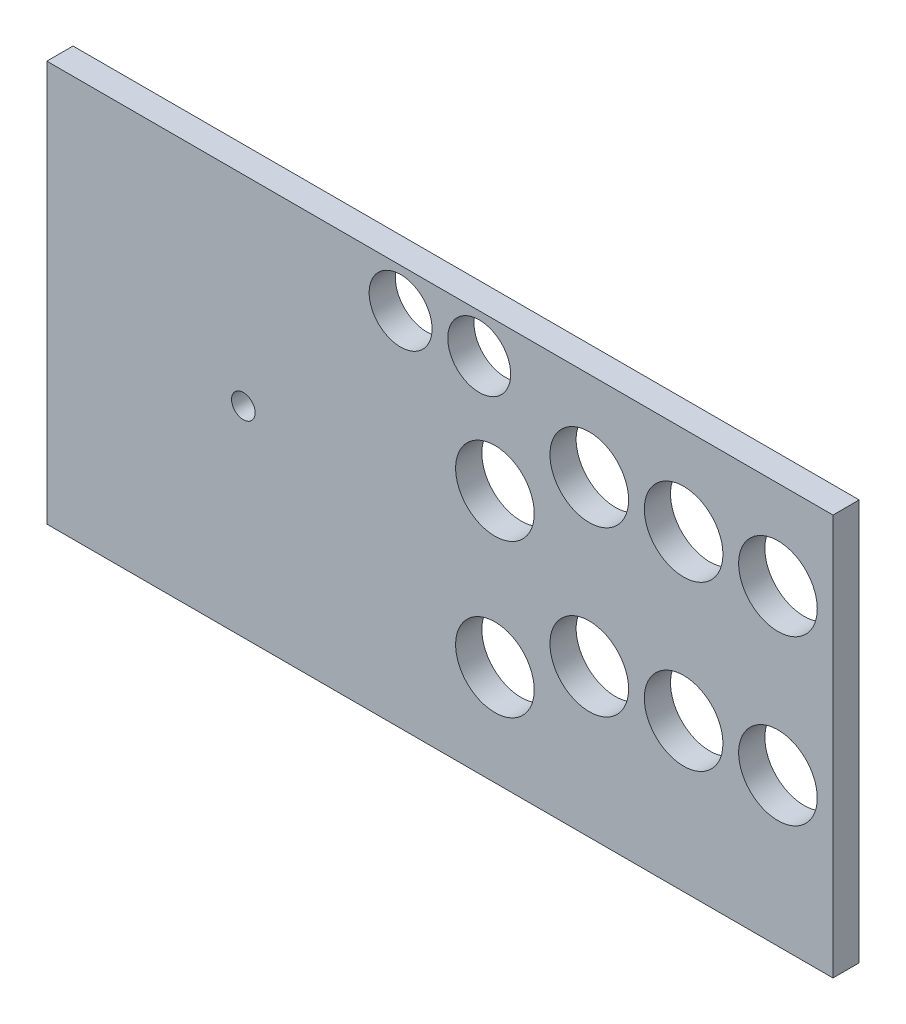
ISO-10303-21;
HEADER;
FILE_DESCRIPTION(('STEP AP214'),'2;1');
FILE_NAME('part.step','',(''),(''),'','','');
FILE_SCHEMA(('AUTOMOTIVE_DESIGN { 1 0 10303 214 1 1 1 1 }'));
ENDSEC;
DATA;
#1=APPLICATION_CONTEXT('core data for automotive mechanical design processes');
#2=APPLICATION_PROTOCOL_DEFINITION('international standard','automotive_design',2000,#1);
#3=PRODUCT_CONTEXT('',#1,'mechanical');
#4=PRODUCT('Part','Part','',(#3));
#5=PRODUCT_RELATED_PRODUCT_CATEGORY('part','',(#4));
#6=PRODUCT_DEFINITION_FORMATION('','',#4);
#7=PRODUCT_DEFINITION_CONTEXT('part definition',#1,'design');
#8=PRODUCT_DEFINITION('design','',#6,#7);
#9=PRODUCT_DEFINITION_SHAPE('','',#8);
#10=(LENGTH_UNIT() NAMED_UNIT(*) SI_UNIT(.MILLI.,.METRE.));
#11=(NAMED_UNIT(*) PLANE_ANGLE_UNIT() SI_UNIT($,.RADIAN.));
#12=(NAMED_UNIT(*) SI_UNIT($,.STERADIAN.) SOLID_ANGLE_UNIT());
#13=UNCERTAINTY_MEASURE_WITH_UNIT(LENGTH_MEASURE(1.E-05),#10,'distance_accuracy_value','');
#14=(GEOMETRIC_REPRESENTATION_CONTEXT(3) GLOBAL_UNCERTAINTY_ASSIGNED_CONTEXT((#13)) GLOBAL_UNIT_ASSIGNED_CONTEXT((#10,
#11,#12)) REPRESENTATION_CONTEXT('',''));
#15=CARTESIAN_POINT('',(0.,0.,0.));
#16=DIRECTION('',(0.,0.,1.));
#17=DIRECTION('',(1.,0.,0.));
#18=AXIS2_PLACEMENT_3D('',#15,#16,#17);
#19=CARTESIAN_POINT('',(0.,0.,10.));
#20=DIRECTION('',(1.,0.,0.));
#21=DIRECTION('',(0.,0.,-1.));
#22=AXIS2_PLACEMENT_3D('',#19,#20,#21);
#23=PLANE('',#22);
#24=DIRECTION('',(0.,-1.,0.));
#25=VECTOR('',#24,1.);
#26=CARTESIAN_POINT('',(0.,0.,0.));
#27=LINE('',#26,#25);
#28=CARTESIAN_POINT('',(0.,153.,0.));
#29=VERTEX_POINT('',#28);
#30=CARTESIAN_POINT('',(0.,0.,0.));
#31=VERTEX_POINT('',#30);
#32=EDGE_CURVE('E99',#29,#31,#27,.T.);
#33=ORIENTED_EDGE('',*,*,#32,.T.);
#34=DIRECTION('',(0.,0.,-1.));
#35=VECTOR('',#34,1.);
#36=CARTESIAN_POINT('',(0.,0.,10.));
#37=LINE('',#36,#35);
#38=CARTESIAN_POINT('',(0.,0.,10.));
#39=VERTEX_POINT('',#38);
#40=EDGE_CURVE('E11',#39,#31,#37,.T.);
#41=ORIENTED_EDGE('',*,*,#40,.F.);
#42=DIRECTION('',(0.,-1.,0.));
#43=VECTOR('',#42,1.);
#44=CARTESIAN_POINT('',(0.,0.,10.));
#45=LINE('',#44,#43);
#46=CARTESIAN_POINT('',(0.,153.,10.));
#47=VERTEX_POINT('',#46);
#48=EDGE_CURVE('E87',#47,#39,#45,.T.);
#49=ORIENTED_EDGE('',*,*,#48,.F.);
#50=DIRECTION('',(0.,0.,-1.));
#51=VECTOR('',#50,1.);
#52=CARTESIAN_POINT('',(0.,153.,10.));
#53=LINE('',#52,#51);
#54=EDGE_CURVE('E95',#47,#29,#53,.T.);
#55=ORIENTED_EDGE('',*,*,#54,.T.);
#56=EDGE_LOOP('',(#33,#41,#49,#55));
#57=FACE_BOUND('',#56,.T.);
#58=ADVANCED_FACE('F36',(#57),#23,.F.);
#59=CARTESIAN_POINT('',(0.,0.,10.));
#60=DIRECTION('',(0.,1.,0.));
#61=DIRECTION('',(0.,0.,1.));
#62=AXIS2_PLACEMENT_3D('',#59,#60,#61);
#63=PLANE('',#62);
#64=DIRECTION('',(1.,0.,0.));
#65=VECTOR('',#64,1.);
#66=CARTESIAN_POINT('',(0.,0.,0.));
#67=LINE('',#66,#65);
#68=CARTESIAN_POINT('',(300.,0.,0.));
#69=VERTEX_POINT('',#68);
#70=EDGE_CURVE('E91',#31,#69,#67,.T.);
#71=ORIENTED_EDGE('',*,*,#70,.T.);
#72=DIRECTION('',(0.,0.,-1.));
#73=VECTOR('',#72,1.);
#74=CARTESIAN_POINT('',(300.,0.,10.));
#75=LINE('',#74,#73);
#76=CARTESIAN_POINT('',(300.,0.,10.));
#77=VERTEX_POINT('',#76);
#78=EDGE_CURVE('E44',#77,#69,#75,.T.);
#79=ORIENTED_EDGE('',*,*,#78,.F.);
#80=DIRECTION('',(1.,0.,0.));
#81=VECTOR('',#80,1.);
#82=CARTESIAN_POINT('',(0.,0.,10.));
#83=LINE('',#82,#81);
#84=EDGE_CURVE('E82',#39,#77,#83,.T.);
#85=ORIENTED_EDGE('',*,*,#84,.F.);
#86=ORIENTED_EDGE('',*,*,#40,.T.);
#87=EDGE_LOOP('',(#71,#79,#85,#86));
#88=FACE_BOUND('',#87,.T.);
#89=ADVANCED_FACE('F90',(#88),#63,.F.);
#90=CARTESIAN_POINT('',(300.,0.,10.));
#91=DIRECTION('',(-1.,0.,0.));
#92=DIRECTION('',(0.,0.,1.));
#93=AXIS2_PLACEMENT_3D('',#90,#91,#92);
#94=PLANE('',#93);
#95=DIRECTION('',(0.,1.,0.));
#96=VECTOR('',#95,1.);
#97=CARTESIAN_POINT('',(300.,0.,0.));
#98=LINE('',#97,#96);
#99=CARTESIAN_POINT('',(300.,153.,0.));
#100=VERTEX_POINT('',#99);
#101=EDGE_CURVE('E69',#69,#100,#98,.T.);
#102=ORIENTED_EDGE('',*,*,#101,.T.);
#103=DIRECTION('',(0.,0.,-1.));
#104=VECTOR('',#103,1.);
#105=CARTESIAN_POINT('',(300.,153.,10.));
#106=LINE('',#105,#104);
#107=CARTESIAN_POINT('',(300.,153.,10.));
#108=VERTEX_POINT('',#107);
#109=EDGE_CURVE('E92',#108,#100,#106,.T.);
#110=ORIENTED_EDGE('',*,*,#109,.F.);
#111=DIRECTION('',(0.,1.,0.));
#112=VECTOR('',#111,1.);
#113=CARTESIAN_POINT('',(300.,0.,10.));
#114=LINE('',#113,#112);
#115=EDGE_CURVE('E85',#77,#108,#114,.T.);
#116=ORIENTED_EDGE('',*,*,#115,.F.);
#117=ORIENTED_EDGE('',*,*,#78,.T.);
#118=EDGE_LOOP('',(#102,#110,#116,#117));
#119=FACE_BOUND('',#118,.T.);
#120=ADVANCED_FACE('F93',(#119),#94,.F.);
#121=CARTESIAN_POINT('',(0.,153.,10.));
#122=DIRECTION('',(0.,-1.,0.));
#123=DIRECTION('',(0.,0.,-1.));
#124=AXIS2_PLACEMENT_3D('',#121,#122,#123);
#125=PLANE('',#124);
#126=DIRECTION('',(-1.,0.,0.));
#127=VECTOR('',#126,1.);
#128=CARTESIAN_POINT('',(0.,153.,0.));
#129=LINE('',#128,#127);
#130=EDGE_CURVE('E75',#100,#29,#129,.T.);
#131=ORIENTED_EDGE('',*,*,#130,.T.);
#132=ORIENTED_EDGE('',*,*,#54,.F.);
#133=DIRECTION('',(-1.,0.,0.));
#134=VECTOR('',#133,1.);
#135=CARTESIAN_POINT('',(0.,153.,10.));
#136=LINE('',#135,#134);
#137=EDGE_CURVE('E52',#108,#47,#136,.T.);
#138=ORIENTED_EDGE('',*,*,#137,.F.);
#139=ORIENTED_EDGE('',*,*,#109,.T.);
#140=EDGE_LOOP('',(#131,#132,#138,#139));
#141=FACE_BOUND('',#140,.T.);
#142=ADVANCED_FACE('F107',(#141),#125,.F.);
#143=CARTESIAN_POINT('',(0.,0.,10.));
#144=DIRECTION('',(0.,0.,-1.));
#145=DIRECTION('',(-1.,0.,0.));
#146=AXIS2_PLACEMENT_3D('',#143,#144,#145);
#147=PLANE('',#146);
#148=CARTESIAN_POINT('',(75.,76.5,10.));
#149=DIRECTION('',(0.,0.,1.));
#150=DIRECTION('',(1.,0.,0.));
#151=AXIS2_PLACEMENT_3D('',#148,#149,#150);
#152=CIRCLE('',#151,4.50000000000001);
#153=CARTESIAN_POINT('',(79.5,76.5,10.));
#154=VERTEX_POINT('',#153);
#155=EDGE_CURVE('E173',#154,#154,#152,.T.);
#156=ORIENTED_EDGE('',*,*,#155,.F.);
#157=EDGE_LOOP('',(#156));
#158=FACE_BOUND('',#157,.T.);
#159=CARTESIAN_POINT('',(135.,138.,10.));
#160=DIRECTION('',(0.,0.,1.));
#161=DIRECTION('',(1.,0.,0.));
#162=AXIS2_PLACEMENT_3D('',#159,#160,#161);
#163=CIRCLE('',#162,12.);
#164=CARTESIAN_POINT('',(147.,138.,10.));
#165=VERTEX_POINT('',#164);
#166=EDGE_CURVE('E167',#165,#165,#163,.T.);
#167=ORIENTED_EDGE('',*,*,#166,.F.);
#168=EDGE_LOOP('',(#167));
#169=FACE_BOUND('',#168,.T.);
#170=CARTESIAN_POINT('',(165.,138.,10.));
#171=DIRECTION('',(0.,0.,1.));
#172=DIRECTION('',(1.,0.,0.));
#173=AXIS2_PLACEMENT_3D('',#170,#171,#172);
#174=CIRCLE('',#173,12.);
#175=CARTESIAN_POINT('',(177.,138.,10.));
#176=VERTEX_POINT('',#175);
#177=EDGE_CURVE('E161',#176,#176,#174,.T.);
#178=ORIENTED_EDGE('',*,*,#177,.F.);
#179=EDGE_LOOP('',(#178));
#180=FACE_BOUND('',#179,.T.);
#181=CARTESIAN_POINT('',(279.,56.5,10.));
#182=DIRECTION('',(0.,0.,1.));
#183=DIRECTION('',(1.,0.,0.));
#184=AXIS2_PLACEMENT_3D('',#181,#182,#183);
#185=CIRCLE('',#184,15.);
#186=CARTESIAN_POINT('',(294.,56.5,10.));
#187=VERTEX_POINT('',#186);
#188=EDGE_CURVE('E155',#187,#187,#185,.T.);
#189=ORIENTED_EDGE('',*,*,#188,.F.);
#190=EDGE_LOOP('',(#189));
#191=FACE_BOUND('',#190,.T.);
#192=CARTESIAN_POINT('',(243.,56.5,10.));
#193=DIRECTION('',(0.,0.,1.));
#194=DIRECTION('',(1.,0.,0.));
#195=AXIS2_PLACEMENT_3D('',#192,#193,#194);
#196=CIRCLE('',#195,15.);
#197=CARTESIAN_POINT('',(258.,56.5,10.));
#198=VERTEX_POINT('',#197);
#199=EDGE_CURVE('E149',#198,#198,#196,.T.);
#200=ORIENTED_EDGE('',*,*,#199,.F.);
#201=EDGE_LOOP('',(#200));
#202=FACE_BOUND('',#201,.T.);
#203=CARTESIAN_POINT('',(207.,56.5,10.));
#204=DIRECTION('',(0.,0.,1.));
#205=DIRECTION('',(1.,0.,0.));
#206=AXIS2_PLACEMENT_3D('',#203,#204,#205);
#207=CIRCLE('',#206,15.);
#208=CARTESIAN_POINT('',(222.,56.5,10.));
#209=VERTEX_POINT('',#208);
#210=EDGE_CURVE('E143',#209,#209,#207,.T.);
#211=ORIENTED_EDGE('',*,*,#210,.F.);
#212=EDGE_LOOP('',(#211));
#213=FACE_BOUND('',#212,.T.);
#214=CARTESIAN_POINT('',(171.,38.2,10.));
#215=DIRECTION('',(0.,0.,1.));
#216=DIRECTION('',(1.,0.,0.));
#217=AXIS2_PLACEMENT_3D('',#214,#215,#216);
#218=CIRCLE('',#217,15.);
#219=CARTESIAN_POINT('',(186.,38.2,10.));
#220=VERTEX_POINT('',#219);
#221=EDGE_CURVE('E137',#220,#220,#218,.T.);
#222=ORIENTED_EDGE('',*,*,#221,.F.);
#223=EDGE_LOOP('',(#222));
#224=FACE_BOUND('',#223,.T.);
#225=CARTESIAN_POINT('',(279.,119.,10.));
#226=DIRECTION('',(0.,0.,1.));
#227=DIRECTION('',(1.,0.,0.));
#228=AXIS2_PLACEMENT_3D('',#225,#226,#227);
#229=CIRCLE('',#228,15.);
#230=CARTESIAN_POINT('',(294.,119.,10.));
#231=VERTEX_POINT('',#230);
#232=EDGE_CURVE('E131',#231,#231,#229,.T.);
#233=ORIENTED_EDGE('',*,*,#232,.F.);
#234=EDGE_LOOP('',(#233));
#235=FACE_BOUND('',#234,.T.);
#236=CARTESIAN_POINT('',(243.,119.,10.));
#237=DIRECTION('',(0.,0.,1.));
#238=DIRECTION('',(1.,0.,0.));
#239=AXIS2_PLACEMENT_3D('',#236,#237,#238);
#240=CIRCLE('',#239,15.);
#241=CARTESIAN_POINT('',(258.,119.,10.));
#242=VERTEX_POINT('',#241);
#243=EDGE_CURVE('E125',#242,#242,#240,.T.);
#244=ORIENTED_EDGE('',*,*,#243,.F.);
#245=EDGE_LOOP('',(#244));
#246=FACE_BOUND('',#245,.T.);
#247=CARTESIAN_POINT('',(207.,119.,10.));
#248=DIRECTION('',(0.,0.,1.));
#249=DIRECTION('',(1.,0.,0.));
#250=AXIS2_PLACEMENT_3D('',#247,#248,#249);
#251=CIRCLE('',#250,15.);
#252=CARTESIAN_POINT('',(222.,119.,10.));
#253=VERTEX_POINT('',#252);
#254=EDGE_CURVE('E119',#253,#253,#251,.T.);
#255=ORIENTED_EDGE('',*,*,#254,.F.);
#256=EDGE_LOOP('',(#255));
#257=FACE_BOUND('',#256,.T.);
#258=CARTESIAN_POINT('',(171.,96.5,10.));
#259=DIRECTION('',(0.,0.,1.));
#260=DIRECTION('',(1.,0.,0.));
#261=AXIS2_PLACEMENT_3D('',#258,#259,#260);
#262=CIRCLE('',#261,15.);
#263=CARTESIAN_POINT('',(186.,96.5,10.));
#264=VERTEX_POINT('',#263);
#265=EDGE_CURVE('E113',#264,#264,#262,.T.);
#266=ORIENTED_EDGE('',*,*,#265,.F.);
#267=EDGE_LOOP('',(#266));
#268=FACE_BOUND('',#267,.T.);
#269=ORIENTED_EDGE('',*,*,#48,.T.);
#270=ORIENTED_EDGE('',*,*,#84,.T.);
#271=ORIENTED_EDGE('',*,*,#115,.T.);
#272=ORIENTED_EDGE('',*,*,#137,.T.);
#273=EDGE_LOOP('',(#269,#270,#271,#272));
#274=FACE_BOUND('',#273,.T.);
#275=ADVANCED_FACE('F83',(#158,#169,#180,#191,#202,#213,#224,#235,#246,#257,#268,#274),#147,.F.);
#276=CARTESIAN_POINT('',(0.,0.,0.));
#277=DIRECTION('',(0.,0.,-1.));
#278=DIRECTION('',(-1.,0.,0.));
#279=AXIS2_PLACEMENT_3D('',#276,#277,#278);
#280=PLANE('',#279);
#281=CARTESIAN_POINT('',(75.,76.5,0.));
#282=DIRECTION('',(0.,0.,1.));
#283=DIRECTION('',(1.,0.,0.));
#284=AXIS2_PLACEMENT_3D('',#281,#282,#283);
#285=CIRCLE('',#284,4.50000000000001);
#286=CARTESIAN_POINT('',(79.5,76.5,0.));
#287=VERTEX_POINT('',#286);
#288=EDGE_CURVE('E170',#287,#287,#285,.T.);
#289=ORIENTED_EDGE('',*,*,#288,.T.);
#290=EDGE_LOOP('',(#289));
#291=FACE_BOUND('',#290,.T.);
#292=CARTESIAN_POINT('',(135.,138.,0.));
#293=DIRECTION('',(0.,0.,1.));
#294=DIRECTION('',(1.,0.,0.));
#295=AXIS2_PLACEMENT_3D('',#292,#293,#294);
#296=CIRCLE('',#295,12.);
#297=CARTESIAN_POINT('',(147.,138.,0.));
#298=VERTEX_POINT('',#297);
#299=EDGE_CURVE('E164',#298,#298,#296,.T.);
#300=ORIENTED_EDGE('',*,*,#299,.T.);
#301=EDGE_LOOP('',(#300));
#302=FACE_BOUND('',#301,.T.);
#303=CARTESIAN_POINT('',(165.,138.,0.));
#304=DIRECTION('',(0.,0.,1.));
#305=DIRECTION('',(1.,0.,0.));
#306=AXIS2_PLACEMENT_3D('',#303,#304,#305);
#307=CIRCLE('',#306,12.);
#308=CARTESIAN_POINT('',(177.,138.,0.));
#309=VERTEX_POINT('',#308);
#310=EDGE_CURVE('E158',#309,#309,#307,.T.);
#311=ORIENTED_EDGE('',*,*,#310,.T.);
#312=EDGE_LOOP('',(#311));
#313=FACE_BOUND('',#312,.T.);
#314=CARTESIAN_POINT('',(279.,56.5,0.));
#315=DIRECTION('',(0.,0.,1.));
#316=DIRECTION('',(1.,0.,0.));
#317=AXIS2_PLACEMENT_3D('',#314,#315,#316);
#318=CIRCLE('',#317,15.);
#319=CARTESIAN_POINT('',(294.,56.5,0.));
#320=VERTEX_POINT('',#319);
#321=EDGE_CURVE('E152',#320,#320,#318,.T.);
#322=ORIENTED_EDGE('',*,*,#321,.T.);
#323=EDGE_LOOP('',(#322));
#324=FACE_BOUND('',#323,.T.);
#325=CARTESIAN_POINT('',(243.,56.5,0.));
#326=DIRECTION('',(0.,0.,1.));
#327=DIRECTION('',(1.,0.,0.));
#328=AXIS2_PLACEMENT_3D('',#325,#326,#327);
#329=CIRCLE('',#328,15.);
#330=CARTESIAN_POINT('',(258.,56.5,0.));
#331=VERTEX_POINT('',#330);
#332=EDGE_CURVE('E146',#331,#331,#329,.T.);
#333=ORIENTED_EDGE('',*,*,#332,.T.);
#334=EDGE_LOOP('',(#333));
#335=FACE_BOUND('',#334,.T.);
#336=CARTESIAN_POINT('',(207.,56.5,0.));
#337=DIRECTION('',(0.,0.,1.));
#338=DIRECTION('',(1.,0.,0.));
#339=AXIS2_PLACEMENT_3D('',#336,#337,#338);
#340=CIRCLE('',#339,15.);
#341=CARTESIAN_POINT('',(222.,56.5,0.));
#342=VERTEX_POINT('',#341);
#343=EDGE_CURVE('E140',#342,#342,#340,.T.);
#344=ORIENTED_EDGE('',*,*,#343,.T.);
#345=EDGE_LOOP('',(#344));
#346=FACE_BOUND('',#345,.T.);
#347=CARTESIAN_POINT('',(171.,38.2,0.));
#348=DIRECTION('',(0.,0.,1.));
#349=DIRECTION('',(1.,0.,0.));
#350=AXIS2_PLACEMENT_3D('',#347,#348,#349);
#351=CIRCLE('',#350,15.);
#352=CARTESIAN_POINT('',(186.,38.2,0.));
#353=VERTEX_POINT('',#352);
#354=EDGE_CURVE('E134',#353,#353,#351,.T.);
#355=ORIENTED_EDGE('',*,*,#354,.T.);
#356=EDGE_LOOP('',(#355));
#357=FACE_BOUND('',#356,.T.);
#358=CARTESIAN_POINT('',(279.,119.,0.));
#359=DIRECTION('',(0.,0.,1.));
#360=DIRECTION('',(1.,0.,0.));
#361=AXIS2_PLACEMENT_3D('',#358,#359,#360);
#362=CIRCLE('',#361,15.);
#363=CARTESIAN_POINT('',(294.,119.,0.));
#364=VERTEX_POINT('',#363);
#365=EDGE_CURVE('E128',#364,#364,#362,.T.);
#366=ORIENTED_EDGE('',*,*,#365,.T.);
#367=EDGE_LOOP('',(#366));
#368=FACE_BOUND('',#367,.T.);
#369=CARTESIAN_POINT('',(243.,119.,0.));
#370=DIRECTION('',(0.,0.,1.));
#371=DIRECTION('',(1.,0.,0.));
#372=AXIS2_PLACEMENT_3D('',#369,#370,#371);
#373=CIRCLE('',#372,15.);
#374=CARTESIAN_POINT('',(258.,119.,0.));
#375=VERTEX_POINT('',#374);
#376=EDGE_CURVE('E122',#375,#375,#373,.T.);
#377=ORIENTED_EDGE('',*,*,#376,.T.);
#378=EDGE_LOOP('',(#377));
#379=FACE_BOUND('',#378,.T.);
#380=CARTESIAN_POINT('',(207.,119.,0.));
#381=DIRECTION('',(0.,0.,1.));
#382=DIRECTION('',(1.,0.,0.));
#383=AXIS2_PLACEMENT_3D('',#380,#381,#382);
#384=CIRCLE('',#383,15.);
#385=CARTESIAN_POINT('',(222.,119.,0.));
#386=VERTEX_POINT('',#385);
#387=EDGE_CURVE('E116',#386,#386,#384,.T.);
#388=ORIENTED_EDGE('',*,*,#387,.T.);
#389=EDGE_LOOP('',(#388));
#390=FACE_BOUND('',#389,.T.);
#391=CARTESIAN_POINT('',(171.,96.5,0.));
#392=DIRECTION('',(0.,0.,1.));
#393=DIRECTION('',(1.,0.,0.));
#394=AXIS2_PLACEMENT_3D('',#391,#392,#393);
#395=CIRCLE('',#394,15.);
#396=CARTESIAN_POINT('',(186.,96.5,0.));
#397=VERTEX_POINT('',#396);
#398=EDGE_CURVE('E102',#397,#397,#395,.T.);
#399=ORIENTED_EDGE('',*,*,#398,.T.);
#400=EDGE_LOOP('',(#399));
#401=FACE_BOUND('',#400,.T.);
#402=ORIENTED_EDGE('',*,*,#32,.F.);
#403=ORIENTED_EDGE('',*,*,#130,.F.);
#404=ORIENTED_EDGE('',*,*,#101,.F.);
#405=ORIENTED_EDGE('',*,*,#70,.F.);
#406=EDGE_LOOP('',(#402,#403,#404,#405));
#407=FACE_BOUND('',#406,.T.);
#408=ADVANCED_FACE('F110',(#291,#302,#313,#324,#335,#346,#357,#368,#379,#390,#401,#407),#280,.T.);
#409=CARTESIAN_POINT('',(171.,96.5,0.));
#410=DIRECTION('',(0.,0.,1.));
#411=DIRECTION('',(1.,0.,0.));
#412=AXIS2_PLACEMENT_3D('',#409,#410,#411);
#413=CYLINDRICAL_SURFACE('',#412,15.);
#414=ORIENTED_EDGE('',*,*,#398,.F.);
#415=EDGE_LOOP('',(#414));
#416=FACE_BOUND('',#415,.T.);
#417=ORIENTED_EDGE('',*,*,#265,.T.);
#418=EDGE_LOOP('',(#417));
#419=FACE_BOUND('',#418,.T.);
#420=ADVANCED_FACE('F211',(#416,#419),#413,.F.);
#421=CARTESIAN_POINT('',(207.,119.,0.));
#422=DIRECTION('',(0.,0.,1.));
#423=DIRECTION('',(1.,0.,0.));
#424=AXIS2_PLACEMENT_3D('',#421,#422,#423);
#425=CYLINDRICAL_SURFACE('',#424,15.);
#426=ORIENTED_EDGE('',*,*,#387,.F.);
#427=EDGE_LOOP('',(#426));
#428=FACE_BOUND('',#427,.T.);
#429=ORIENTED_EDGE('',*,*,#254,.T.);
#430=EDGE_LOOP('',(#429));
#431=FACE_BOUND('',#430,.T.);
#432=ADVANCED_FACE('F213',(#428,#431),#425,.F.);
#433=CARTESIAN_POINT('',(243.,119.,0.));
#434=DIRECTION('',(0.,0.,1.));
#435=DIRECTION('',(1.,0.,0.));
#436=AXIS2_PLACEMENT_3D('',#433,#434,#435);
#437=CYLINDRICAL_SURFACE('',#436,15.);
#438=ORIENTED_EDGE('',*,*,#376,.F.);
#439=EDGE_LOOP('',(#438));
#440=FACE_BOUND('',#439,.T.);
#441=ORIENTED_EDGE('',*,*,#243,.T.);
#442=EDGE_LOOP('',(#441));
#443=FACE_BOUND('',#442,.T.);
#444=ADVANCED_FACE('F220',(#440,#443),#437,.F.);
#445=CARTESIAN_POINT('',(279.,119.,0.));
#446=DIRECTION('',(0.,0.,1.));
#447=DIRECTION('',(1.,0.,0.));
#448=AXIS2_PLACEMENT_3D('',#445,#446,#447);
#449=CYLINDRICAL_SURFACE('',#448,15.);
#450=ORIENTED_EDGE('',*,*,#365,.F.);
#451=EDGE_LOOP('',(#450));
#452=FACE_BOUND('',#451,.T.);
#453=ORIENTED_EDGE('',*,*,#232,.T.);
#454=EDGE_LOOP('',(#453));
#455=FACE_BOUND('',#454,.T.);
#456=ADVANCED_FACE('F302',(#452,#455),#449,.F.);
#457=CARTESIAN_POINT('',(171.,38.2,0.));
#458=DIRECTION('',(0.,0.,1.));
#459=DIRECTION('',(1.,0.,0.));
#460=AXIS2_PLACEMENT_3D('',#457,#458,#459);
#461=CYLINDRICAL_SURFACE('',#460,15.);
#462=ORIENTED_EDGE('',*,*,#354,.F.);
#463=EDGE_LOOP('',(#462));
#464=FACE_BOUND('',#463,.T.);
#465=ORIENTED_EDGE('',*,*,#221,.T.);
#466=EDGE_LOOP('',(#465));
#467=FACE_BOUND('',#466,.T.);
#468=ADVANCED_FACE('F294',(#464,#467),#461,.F.);
#469=CARTESIAN_POINT('',(207.,56.5,0.));
#470=DIRECTION('',(0.,0.,1.));
#471=DIRECTION('',(1.,0.,0.));
#472=AXIS2_PLACEMENT_3D('',#469,#470,#471);
#473=CYLINDRICAL_SURFACE('',#472,15.);
#474=ORIENTED_EDGE('',*,*,#343,.F.);
#475=EDGE_LOOP('',(#474));
#476=FACE_BOUND('',#475,.T.);
#477=ORIENTED_EDGE('',*,*,#210,.T.);
#478=EDGE_LOOP('',(#477));
#479=FACE_BOUND('',#478,.T.);
#480=ADVANCED_FACE('F286',(#476,#479),#473,.F.);
#481=CARTESIAN_POINT('',(243.,56.5,0.));
#482=DIRECTION('',(0.,0.,1.));
#483=DIRECTION('',(1.,0.,0.));
#484=AXIS2_PLACEMENT_3D('',#481,#482,#483);
#485=CYLINDRICAL_SURFACE('',#484,15.);
#486=ORIENTED_EDGE('',*,*,#332,.F.);
#487=EDGE_LOOP('',(#486));
#488=FACE_BOUND('',#487,.T.);
#489=ORIENTED_EDGE('',*,*,#199,.T.);
#490=EDGE_LOOP('',(#489));
#491=FACE_BOUND('',#490,.T.);
#492=ADVANCED_FACE('F278',(#488,#491),#485,.F.);
#493=CARTESIAN_POINT('',(279.,56.5,0.));
#494=DIRECTION('',(0.,0.,1.));
#495=DIRECTION('',(1.,0.,0.));
#496=AXIS2_PLACEMENT_3D('',#493,#494,#495);
#497=CYLINDRICAL_SURFACE('',#496,15.);
#498=ORIENTED_EDGE('',*,*,#321,.F.);
#499=EDGE_LOOP('',(#498));
#500=FACE_BOUND('',#499,.T.);
#501=ORIENTED_EDGE('',*,*,#188,.T.);
#502=EDGE_LOOP('',(#501));
#503=FACE_BOUND('',#502,.T.);
#504=ADVANCED_FACE('F270',(#500,#503),#497,.F.);
#505=CARTESIAN_POINT('',(165.,138.,0.));
#506=DIRECTION('',(0.,0.,1.));
#507=DIRECTION('',(1.,0.,0.));
#508=AXIS2_PLACEMENT_3D('',#505,#506,#507);
#509=CYLINDRICAL_SURFACE('',#508,12.);
#510=ORIENTED_EDGE('',*,*,#310,.F.);
#511=EDGE_LOOP('',(#510));
#512=FACE_BOUND('',#511,.T.);
#513=ORIENTED_EDGE('',*,*,#177,.T.);
#514=EDGE_LOOP('',(#513));
#515=FACE_BOUND('',#514,.T.);
#516=ADVANCED_FACE('F263',(#512,#515),#509,.F.);
#517=CARTESIAN_POINT('',(135.,138.,0.));
#518=DIRECTION('',(0.,0.,1.));
#519=DIRECTION('',(1.,0.,0.));
#520=AXIS2_PLACEMENT_3D('',#517,#518,#519);
#521=CYLINDRICAL_SURFACE('',#520,12.);
#522=ORIENTED_EDGE('',*,*,#299,.F.);
#523=EDGE_LOOP('',(#522));
#524=FACE_BOUND('',#523,.T.);
#525=ORIENTED_EDGE('',*,*,#166,.T.);
#526=EDGE_LOOP('',(#525));
#527=FACE_BOUND('',#526,.T.);
#528=ADVANCED_FACE('F184',(#524,#527),#521,.F.);
#529=CARTESIAN_POINT('',(75.,76.5,0.));
#530=DIRECTION('',(0.,0.,1.));
#531=DIRECTION('',(1.,0.,0.));
#532=AXIS2_PLACEMENT_3D('',#529,#530,#531);
#533=CYLINDRICAL_SURFACE('',#532,4.50000000000001);
#534=ORIENTED_EDGE('',*,*,#288,.F.);
#535=EDGE_LOOP('',(#534));
#536=FACE_BOUND('',#535,.T.);
#537=ORIENTED_EDGE('',*,*,#155,.T.);
#538=EDGE_LOOP('',(#537));
#539=FACE_BOUND('',#538,.T.);
#540=ADVANCED_FACE('F181',(#536,#539),#533,.F.);
#541=CLOSED_SHELL('',(#58,#89,#120,#142,#275,#408,#420,#432,#444,#456,#468,#480,#492,#504,#516,
#528,#540));
#542=MANIFOLD_SOLID_BREP('B2',#541);
#543=ADVANCED_BREP_SHAPE_REPRESENTATION('',(#18,#542),#14);
#544=SHAPE_DEFINITION_REPRESENTATION(#9,#543);
ENDSEC;
END-ISO-10303-21;
